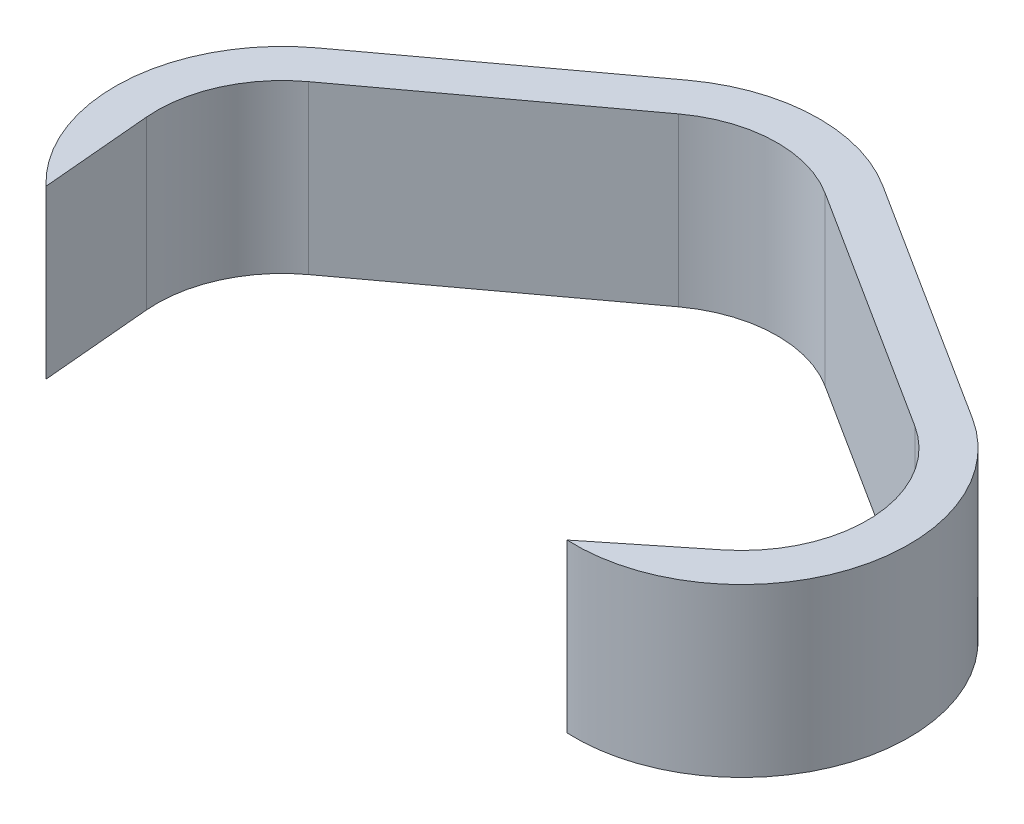
ISO-10303-21;
HEADER;
FILE_DESCRIPTION(('STEP AP214'),'2;1');
FILE_NAME('part.step','',(''),(''),'','','');
FILE_SCHEMA(('AUTOMOTIVE_DESIGN { 1 0 10303 214 1 1 1 1 }'));
ENDSEC;
DATA;
#1=APPLICATION_CONTEXT('core data for automotive mechanical design processes');
#2=APPLICATION_PROTOCOL_DEFINITION('international standard','automotive_design',2000,#1);
#3=PRODUCT_CONTEXT('',#1,'mechanical');
#4=PRODUCT('Part','Part','',(#3));
#5=PRODUCT_RELATED_PRODUCT_CATEGORY('part','',(#4));
#6=PRODUCT_DEFINITION_FORMATION('','',#4);
#7=PRODUCT_DEFINITION_CONTEXT('part definition',#1,'design');
#8=PRODUCT_DEFINITION('design','',#6,#7);
#9=PRODUCT_DEFINITION_SHAPE('','',#8);
#10=(LENGTH_UNIT() NAMED_UNIT(*) SI_UNIT(.MILLI.,.METRE.));
#11=(NAMED_UNIT(*) PLANE_ANGLE_UNIT() SI_UNIT($,.RADIAN.));
#12=(NAMED_UNIT(*) SI_UNIT($,.STERADIAN.) SOLID_ANGLE_UNIT());
#13=UNCERTAINTY_MEASURE_WITH_UNIT(LENGTH_MEASURE(1.E-05),#10,'distance_accuracy_value','');
#14=(GEOMETRIC_REPRESENTATION_CONTEXT(3) GLOBAL_UNCERTAINTY_ASSIGNED_CONTEXT((#13)) GLOBAL_UNIT_ASSIGNED_CONTEXT((#10,
#11,#12)) REPRESENTATION_CONTEXT('',''));
#15=CARTESIAN_POINT('',(0.,0.,0.));
#16=DIRECTION('',(0.,0.,1.));
#17=DIRECTION('',(1.,0.,0.));
#18=AXIS2_PLACEMENT_3D('',#15,#16,#17);
#19=CARTESIAN_POINT('',(-11.3075349976395,25.4,-15.3310845107956));
#20=DIRECTION('',(0.593571390952207,0.,0.804781339149376));
#21=DIRECTION('',(0.804781339149376,0.,-0.593571390952207));
#22=AXIS2_PLACEMENT_3D('',#19,#20,#21);
#23=PLANE('',#22);
#24=DIRECTION('',(-0.804781339149376,0.,0.593571390952207));
#25=VECTOR('',#24,1.);
#26=CARTESIAN_POINT('',(-11.3075349976395,0.,-15.3310845107956));
#27=LINE('',#26,#25);
#28=CARTESIAN_POINT('',(-11.3075349976395,0.,-15.3310845107956));
#29=VERTEX_POINT('',#28);
#30=CARTESIAN_POINT('',(-43.6511110666287,0.,8.5241175195226));
#31=VERTEX_POINT('',#30);
#32=EDGE_CURVE('E156',#29,#31,#27,.T.);
#33=ORIENTED_EDGE('',*,*,#32,.F.);
#34=DIRECTION('',(0.,-1.,0.));
#35=VECTOR('',#34,1.);
#36=CARTESIAN_POINT('',(-11.3075349976395,25.4,-15.3310845107956));
#37=LINE('',#36,#35);
#38=CARTESIAN_POINT('',(-11.3075349976395,25.4,-15.3310845107956));
#39=VERTEX_POINT('',#38);
#40=EDGE_CURVE('E11',#39,#29,#37,.T.);
#41=ORIENTED_EDGE('',*,*,#40,.F.);
#42=DIRECTION('',(-0.804781339149376,0.,0.593571390952207));
#43=VECTOR('',#42,1.);
#44=CARTESIAN_POINT('',(-11.3075349976395,25.4,-15.3310845107956));
#45=LINE('',#44,#43);
#46=CARTESIAN_POINT('',(-43.6511110666287,25.4,8.5241175195226));
#47=VERTEX_POINT('',#46);
#48=EDGE_CURVE('E189',#39,#47,#45,.T.);
#49=ORIENTED_EDGE('',*,*,#48,.T.);
#50=DIRECTION('',(0.,-1.,0.));
#51=VECTOR('',#50,1.);
#52=CARTESIAN_POINT('',(-43.6511110666287,25.4,8.5241175195226));
#53=LINE('',#52,#51);
#54=EDGE_CURVE('E60',#47,#31,#53,.T.);
#55=ORIENTED_EDGE('',*,*,#54,.T.);
#56=EDGE_LOOP('',(#33,#41,#49,#55));
#57=FACE_BOUND('',#56,.T.);
#58=ADVANCED_FACE('F41',(#57),#23,.T.);
#59=CARTESIAN_POINT('',(0.,25.4,0.));
#60=DIRECTION('',(0.,-1.,0.));
#61=DIRECTION('',(0.,0.,-1.));
#62=AXIS2_PLACEMENT_3D('',#59,#60,#61);
#63=CYLINDRICAL_SURFACE('',#62,19.05);
#64=CARTESIAN_POINT('',(0.,0.,0.));
#65=DIRECTION('',(0.,1.,0.));
#66=DIRECTION('',(0.,0.,1.));
#67=AXIS2_PLACEMENT_3D('',#64,#65,#66);
#68=CIRCLE('',#67,19.05);
#69=CARTESIAN_POINT('',(10.2236580129935,0.,-16.0741816847189));
#70=VERTEX_POINT('',#69);
#71=EDGE_CURVE('E159',#70,#29,#68,.T.);
#72=ORIENTED_EDGE('',*,*,#71,.F.);
#73=DIRECTION('',(0.,-1.,0.));
#74=VECTOR('',#73,1.);
#75=CARTESIAN_POINT('',(10.2236580129935,25.4,-16.0741816847189));
#76=LINE('',#75,#74);
#77=CARTESIAN_POINT('',(10.2236580129935,25.4,-16.0741816847189));
#78=VERTEX_POINT('',#77);
#79=EDGE_CURVE('E47',#78,#70,#76,.T.);
#80=ORIENTED_EDGE('',*,*,#79,.F.);
#81=CARTESIAN_POINT('',(0.,25.4,0.));
#82=DIRECTION('',(0.,1.,0.));
#83=DIRECTION('',(0.,0.,1.));
#84=AXIS2_PLACEMENT_3D('',#81,#82,#83);
#85=CIRCLE('',#84,19.05);
#86=EDGE_CURVE('E220',#78,#39,#85,.T.);
#87=ORIENTED_EDGE('',*,*,#86,.T.);
#88=ORIENTED_EDGE('',*,*,#40,.T.);
#89=EDGE_LOOP('',(#72,#80,#87,#88));
#90=FACE_BOUND('',#89,.T.);
#91=ADVANCED_FACE('F216',(#90),#63,.F.);
#92=CARTESIAN_POINT('',(10.2236580129935,25.4,-16.0741816847189));
#93=DIRECTION('',(0.536674961311996,0.,-0.843789064814642));
#94=DIRECTION('',(-0.843789064814642,0.,-0.536674961311996));
#95=AXIS2_PLACEMENT_3D('',#92,#93,#94);
#96=PLANE('',#95);
#97=DIRECTION('',(0.843789064814642,0.,0.536674961311996));
#98=VECTOR('',#97,1.);
#99=CARTESIAN_POINT('',(10.2236580129935,0.,-16.0741816847189));
#100=LINE('',#99,#98);
#101=CARTESIAN_POINT('',(47.7300819440043,0.,7.78102034559929));
#102=VERTEX_POINT('',#101);
#103=EDGE_CURVE('E161',#70,#102,#100,.T.);
#104=ORIENTED_EDGE('',*,*,#103,.T.);
#105=DIRECTION('',(0.,-1.,0.));
#106=VECTOR('',#105,1.);
#107=CARTESIAN_POINT('',(47.7300819440043,25.4,7.78102034559929));
#108=LINE('',#107,#106);
#109=CARTESIAN_POINT('',(47.7300819440043,25.4,7.78102034559929));
#110=VERTEX_POINT('',#109);
#111=EDGE_CURVE('E201',#110,#102,#108,.T.);
#112=ORIENTED_EDGE('',*,*,#111,.F.);
#113=DIRECTION('',(0.843789064814642,0.,0.536674961311996));
#114=VECTOR('',#113,1.);
#115=CARTESIAN_POINT('',(10.2236580129935,25.4,-16.0741816847189));
#116=LINE('',#115,#114);
#117=EDGE_CURVE('E209',#78,#110,#116,.T.);
#118=ORIENTED_EDGE('',*,*,#117,.F.);
#119=ORIENTED_EDGE('',*,*,#79,.T.);
#120=EDGE_LOOP('',(#104,#112,#118,#119));
#121=FACE_BOUND('',#120,.T.);
#122=ADVANCED_FACE('F210',(#121),#96,.F.);
#123=CARTESIAN_POINT('',(37.5064239310108,25.4,23.8552020303182));
#124=DIRECTION('',(0.,-1.,0.));
#125=DIRECTION('',(0.,0.,-1.));
#126=AXIS2_PLACEMENT_3D('',#123,#124,#125);
#127=CYLINDRICAL_SURFACE('',#126,19.05);
#128=CARTESIAN_POINT('',(37.5064239310108,0.,23.8552020303182));
#129=DIRECTION('',(0.,1.,0.));
#130=DIRECTION('',(0.,0.,1.));
#131=AXIS2_PLACEMENT_3D('',#128,#129,#130);
#132=CIRCLE('',#131,19.05);
#133=CARTESIAN_POINT('',(49.4279657924979,0.,38.7138473132776));
#134=VERTEX_POINT('',#133);
#135=EDGE_CURVE('E168',#134,#102,#132,.T.);
#136=ORIENTED_EDGE('',*,*,#135,.F.);
#137=DIRECTION('',(0.,-1.,0.));
#138=VECTOR('',#137,1.);
#139=CARTESIAN_POINT('',(49.4279657924979,25.4,38.7138473132776));
#140=LINE('',#139,#138);
#141=CARTESIAN_POINT('',(49.4279657924979,25.4,38.7138473132776));
#142=VERTEX_POINT('',#141);
#143=EDGE_CURVE('E203',#142,#134,#140,.T.);
#144=ORIENTED_EDGE('',*,*,#143,.F.);
#145=CARTESIAN_POINT('',(37.5064239310108,25.4,23.8552020303182));
#146=DIRECTION('',(0.,1.,0.));
#147=DIRECTION('',(0.,0.,1.));
#148=AXIS2_PLACEMENT_3D('',#145,#146,#147);
#149=CIRCLE('',#148,19.05);
#150=EDGE_CURVE('E422',#142,#110,#149,.T.);
#151=ORIENTED_EDGE('',*,*,#150,.T.);
#152=ORIENTED_EDGE('',*,*,#111,.T.);
#153=EDGE_LOOP('',(#136,#144,#151,#152));
#154=FACE_BOUND('',#153,.T.);
#155=ADVANCED_FACE('F236',(#154),#127,.F.);
#156=CARTESIAN_POINT('',(38.2542162502866,25.4,47.6788855371872));
#157=DIRECTION('',(-0.625802722387774,0.,-0.779981379682906));
#158=DIRECTION('',(-0.779981379682907,0.,0.625802722387774));
#159=AXIS2_PLACEMENT_3D('',#156,#157,#158);
#160=PLANE('',#159);
#161=DIRECTION('',(0.779981379682906,0.,-0.625802722387774));
#162=VECTOR('',#161,1.);
#163=CARTESIAN_POINT('',(38.2542162502866,0.,47.6788855371872));
#164=LINE('',#163,#162);
#165=CARTESIAN_POINT('',(36.3238723798202,0.,49.2276589832579));
#166=VERTEX_POINT('',#165);
#167=EDGE_CURVE('E169',#166,#134,#164,.T.);
#168=ORIENTED_EDGE('',*,*,#167,.F.);
#169=DIRECTION('',(0.,-1.,0.));
#170=VECTOR('',#169,1.);
#171=CARTESIAN_POINT('',(36.3238723798202,25.4,49.2276589832579));
#172=LINE('',#171,#170);
#173=CARTESIAN_POINT('',(36.3238723798202,25.4,49.2276589832579));
#174=VERTEX_POINT('',#173);
#175=EDGE_CURVE('E198',#174,#166,#172,.T.);
#176=ORIENTED_EDGE('',*,*,#175,.F.);
#177=DIRECTION('',(0.779981379682906,0.,-0.625802722387774));
#178=VECTOR('',#177,1.);
#179=CARTESIAN_POINT('',(38.2542162502866,25.4,47.6788855371872));
#180=LINE('',#179,#178);
#181=EDGE_CURVE('E417',#174,#142,#180,.T.);
#182=ORIENTED_EDGE('',*,*,#181,.T.);
#183=ORIENTED_EDGE('',*,*,#143,.T.);
#184=EDGE_LOOP('',(#168,#176,#182,#183));
#185=FACE_BOUND('',#184,.T.);
#186=ADVANCED_FACE('F241',(#185),#160,.T.);
#187=CARTESIAN_POINT('',(37.5064239310108,25.4,23.8552020303182));
#188=DIRECTION('',(0.,-1.,0.));
#189=DIRECTION('',(0.,0.,-1.));
#190=AXIS2_PLACEMENT_3D('',#187,#188,#189);
#191=CYLINDRICAL_SURFACE('',#190,25.4);
#192=CARTESIAN_POINT('',(37.5064239310108,0.,23.8552020303182));
#193=DIRECTION('',(0.,1.,0.));
#194=DIRECTION('',(0.,0.,1.));
#195=AXIS2_PLACEMENT_3D('',#192,#193,#194);
#196=CIRCLE('',#195,25.4);
#197=CARTESIAN_POINT('',(51.1379679483355,0.,2.42295978402633));
#198=VERTEX_POINT('',#197);
#199=EDGE_CURVE('E175',#166,#198,#196,.T.);
#200=ORIENTED_EDGE('',*,*,#199,.T.);
#201=DIRECTION('',(0.,-1.,0.));
#202=VECTOR('',#201,1.);
#203=CARTESIAN_POINT('',(51.1379679483355,25.4,2.42295978402633));
#204=LINE('',#203,#202);
#205=CARTESIAN_POINT('',(51.1379679483355,25.4,2.42295978402633));
#206=VERTEX_POINT('',#205);
#207=EDGE_CURVE('E196',#206,#198,#204,.T.);
#208=ORIENTED_EDGE('',*,*,#207,.F.);
#209=CARTESIAN_POINT('',(37.5064239310108,25.4,23.8552020303182));
#210=DIRECTION('',(0.,1.,0.));
#211=DIRECTION('',(0.,0.,1.));
#212=AXIS2_PLACEMENT_3D('',#209,#210,#211);
#213=CIRCLE('',#212,25.4);
#214=EDGE_CURVE('E425',#174,#206,#213,.T.);
#215=ORIENTED_EDGE('',*,*,#214,.F.);
#216=ORIENTED_EDGE('',*,*,#175,.T.);
#217=EDGE_LOOP('',(#200,#208,#215,#216));
#218=FACE_BOUND('',#217,.T.);
#219=ADVANCED_FACE('F244',(#218),#191,.T.);
#220=CARTESIAN_POINT('',(13.6315440173247,25.4,-21.4322422462919));
#221=DIRECTION('',(0.536674961311996,0.,-0.843789064814642));
#222=DIRECTION('',(-0.843789064814642,0.,-0.536674961311996));
#223=AXIS2_PLACEMENT_3D('',#220,#221,#222);
#224=PLANE('',#223);
#225=DIRECTION('',(0.843789064814642,0.,0.536674961311996));
#226=VECTOR('',#225,1.);
#227=CARTESIAN_POINT('',(13.6315440173247,0.,-21.4322422462919));
#228=LINE('',#227,#226);
#229=CARTESIAN_POINT('',(13.6315440173247,0.,-21.4322422462919));
#230=VERTEX_POINT('',#229);
#231=EDGE_CURVE('E174',#230,#198,#228,.T.);
#232=ORIENTED_EDGE('',*,*,#231,.F.);
#233=DIRECTION('',(0.,-1.,0.));
#234=VECTOR('',#233,1.);
#235=CARTESIAN_POINT('',(13.6315440173247,25.4,-21.4322422462919));
#236=LINE('',#235,#234);
#237=CARTESIAN_POINT('',(13.6315440173247,25.4,-21.4322422462919));
#238=VERTEX_POINT('',#237);
#239=EDGE_CURVE('E193',#238,#230,#236,.T.);
#240=ORIENTED_EDGE('',*,*,#239,.F.);
#241=DIRECTION('',(0.843789064814642,0.,0.536674961311996));
#242=VECTOR('',#241,1.);
#243=CARTESIAN_POINT('',(13.6315440173247,25.4,-21.4322422462919));
#244=LINE('',#243,#242);
#245=EDGE_CURVE('E413',#238,#206,#244,.T.);
#246=ORIENTED_EDGE('',*,*,#245,.T.);
#247=ORIENTED_EDGE('',*,*,#207,.T.);
#248=EDGE_LOOP('',(#232,#240,#246,#247));
#249=FACE_BOUND('',#248,.T.);
#250=ADVANCED_FACE('F248',(#249),#224,.T.);
#251=CARTESIAN_POINT('',(0.,25.4,0.));
#252=DIRECTION('',(0.,-1.,0.));
#253=DIRECTION('',(0.,0.,-1.));
#254=AXIS2_PLACEMENT_3D('',#251,#252,#253);
#255=CYLINDRICAL_SURFACE('',#254,25.4);
#256=CARTESIAN_POINT('',(0.,0.,0.));
#257=DIRECTION('',(0.,1.,0.));
#258=DIRECTION('',(0.,0.,1.));
#259=AXIS2_PLACEMENT_3D('',#256,#257,#258);
#260=CIRCLE('',#259,25.4);
#261=CARTESIAN_POINT('',(-15.0767133301861,0.,-20.4414460143941));
#262=VERTEX_POINT('',#261);
#263=EDGE_CURVE('E178',#230,#262,#260,.T.);
#264=ORIENTED_EDGE('',*,*,#263,.T.);
#265=DIRECTION('',(0.,-1.,0.));
#266=VECTOR('',#265,1.);
#267=CARTESIAN_POINT('',(-15.0767133301861,25.4,-20.4414460143941));
#268=LINE('',#267,#266);
#269=CARTESIAN_POINT('',(-15.0767133301861,25.4,-20.4414460143941));
#270=VERTEX_POINT('',#269);
#271=EDGE_CURVE('E195',#270,#262,#268,.T.);
#272=ORIENTED_EDGE('',*,*,#271,.F.);
#273=CARTESIAN_POINT('',(0.,25.4,0.));
#274=DIRECTION('',(0.,1.,0.));
#275=DIRECTION('',(0.,0.,1.));
#276=AXIS2_PLACEMENT_3D('',#273,#274,#275);
#277=CIRCLE('',#276,25.4);
#278=EDGE_CURVE('E431',#238,#270,#277,.T.);
#279=ORIENTED_EDGE('',*,*,#278,.F.);
#280=ORIENTED_EDGE('',*,*,#239,.T.);
#281=EDGE_LOOP('',(#264,#272,#279,#280));
#282=FACE_BOUND('',#281,.T.);
#283=ADVANCED_FACE('F254',(#282),#255,.T.);
#284=CARTESIAN_POINT('',(-15.0767133301861,25.4,-20.4414460143942));
#285=DIRECTION('',(0.593571390952207,0.,0.804781339149376));
#286=DIRECTION('',(0.804781339149376,0.,-0.593571390952207));
#287=AXIS2_PLACEMENT_3D('',#284,#285,#286);
#288=PLANE('',#287);
#289=DIRECTION('',(-0.804781339149376,0.,0.593571390952207));
#290=VECTOR('',#289,1.);
#291=CARTESIAN_POINT('',(-15.0767133301861,0.,-20.4414460143942));
#292=LINE('',#291,#290);
#293=CARTESIAN_POINT('',(-47.4202893991752,0.,3.41375601592407));
#294=VERTEX_POINT('',#293);
#295=EDGE_CURVE('E179',#262,#294,#292,.T.);
#296=ORIENTED_EDGE('',*,*,#295,.T.);
#297=DIRECTION('',(0.,-1.,0.));
#298=VECTOR('',#297,1.);
#299=CARTESIAN_POINT('',(-47.4202893991752,25.4,3.41375601592407));
#300=LINE('',#299,#298);
#301=CARTESIAN_POINT('',(-47.4202893991752,25.4,3.41375601592407));
#302=VERTEX_POINT('',#301);
#303=EDGE_CURVE('E148',#302,#294,#300,.T.);
#304=ORIENTED_EDGE('',*,*,#303,.F.);
#305=DIRECTION('',(-0.804781339149376,0.,0.593571390952207));
#306=VECTOR('',#305,1.);
#307=CARTESIAN_POINT('',(-15.0767133301861,25.4,-20.4414460143942));
#308=LINE('',#307,#306);
#309=EDGE_CURVE('E136',#270,#302,#308,.T.);
#310=ORIENTED_EDGE('',*,*,#309,.F.);
#311=ORIENTED_EDGE('',*,*,#271,.T.);
#312=EDGE_LOOP('',(#296,#304,#310,#311));
#313=FACE_BOUND('',#312,.T.);
#314=ADVANCED_FACE('F260',(#313),#288,.F.);
#315=CARTESIAN_POINT('',(-32.3435760689892,25.4,23.8552020303182));
#316=DIRECTION('',(0.,-1.,0.));
#317=DIRECTION('',(0.,0.,-1.));
#318=AXIS2_PLACEMENT_3D('',#315,#316,#317);
#319=CYLINDRICAL_SURFACE('',#318,25.4);
#320=CARTESIAN_POINT('',(-32.3435760689892,0.,23.8552020303182));
#321=DIRECTION('',(0.,1.,0.));
#322=DIRECTION('',(0.,0.,1.));
#323=AXIS2_PLACEMENT_3D('',#320,#321,#322);
#324=CIRCLE('',#323,25.4);
#325=CARTESIAN_POINT('',(-49.8465429949894,0.,42.2618896407315));
#326=VERTEX_POINT('',#325);
#327=EDGE_CURVE('E150',#294,#326,#324,.T.);
#328=ORIENTED_EDGE('',*,*,#327,.T.);
#329=DIRECTION('',(0.,-1.,0.));
#330=VECTOR('',#329,1.);
#331=CARTESIAN_POINT('',(-49.8465429949894,25.4,42.2618896407315));
#332=LINE('',#331,#330);
#333=CARTESIAN_POINT('',(-49.8465429949894,25.4,42.2618896407315));
#334=VERTEX_POINT('',#333);
#335=EDGE_CURVE('E144',#334,#326,#332,.T.);
#336=ORIENTED_EDGE('',*,*,#335,.F.);
#337=CARTESIAN_POINT('',(-32.3435760689892,25.4,23.8552020303182));
#338=DIRECTION('',(0.,1.,0.));
#339=DIRECTION('',(0.,0.,1.));
#340=AXIS2_PLACEMENT_3D('',#337,#338,#339);
#341=CIRCLE('',#340,25.4);
#342=EDGE_CURVE('E134',#302,#334,#341,.T.);
#343=ORIENTED_EDGE('',*,*,#342,.F.);
#344=ORIENTED_EDGE('',*,*,#303,.T.);
#345=EDGE_LOOP('',(#328,#336,#343,#344));
#346=FACE_BOUND('',#345,.T.);
#347=ADVANCED_FACE('F143',(#346),#319,.T.);
#348=CARTESIAN_POINT('',(-53.1556503920439,25.4,4.68044108662597));
#349=DIRECTION('',(0.996145852909527,0.,-0.0877122553076252));
#350=DIRECTION('',(-0.0877122553076252,0.,-0.996145852909528));
#351=AXIS2_PLACEMENT_3D('',#348,#349,#350);
#352=PLANE('',#351);
#353=DIRECTION('',(0.0877122553076252,0.,0.996145852909528));
#354=VECTOR('',#353,1.);
#355=CARTESIAN_POINT('',(-53.1556503920439,0.,4.68044108662597));
#356=LINE('',#355,#354);
#357=CARTESIAN_POINT('',(-51.3201545669157,0.,25.5261204939285));
#358=VERTEX_POINT('',#357);
#359=EDGE_CURVE('E182',#358,#326,#356,.T.);
#360=ORIENTED_EDGE('',*,*,#359,.F.);
#361=DIRECTION('',(0.,-1.,0.));
#362=VECTOR('',#361,1.);
#363=CARTESIAN_POINT('',(-51.3201545669157,25.4,25.5261204939285));
#364=LINE('',#363,#362);
#365=CARTESIAN_POINT('',(-51.3201545669157,25.4,25.5261204939285));
#366=VERTEX_POINT('',#365);
#367=EDGE_CURVE('E92',#366,#358,#364,.T.);
#368=ORIENTED_EDGE('',*,*,#367,.F.);
#369=DIRECTION('',(0.0877122553076252,0.,0.996145852909528));
#370=VECTOR('',#369,1.);
#371=CARTESIAN_POINT('',(-53.1556503920439,25.4,4.68044108662597));
#372=LINE('',#371,#370);
#373=EDGE_CURVE('E138',#366,#334,#372,.T.);
#374=ORIENTED_EDGE('',*,*,#373,.T.);
#375=ORIENTED_EDGE('',*,*,#335,.T.);
#376=EDGE_LOOP('',(#360,#368,#374,#375));
#377=FACE_BOUND('',#376,.T.);
#378=ADVANCED_FACE('F151',(#377),#352,.T.);
#379=CARTESIAN_POINT('',(-32.3435760689892,25.4,23.8552020303182));
#380=DIRECTION('',(0.,-1.,0.));
#381=DIRECTION('',(0.,0.,-1.));
#382=AXIS2_PLACEMENT_3D('',#379,#380,#381);
#383=CYLINDRICAL_SURFACE('',#382,19.05);
#384=CARTESIAN_POINT('',(-32.3435760689892,0.,23.8552020303182));
#385=DIRECTION('',(0.,1.,0.));
#386=DIRECTION('',(0.,0.,1.));
#387=AXIS2_PLACEMENT_3D('',#384,#385,#386);
#388=CIRCLE('',#387,19.05);
#389=EDGE_CURVE('E184',#31,#358,#388,.T.);
#390=ORIENTED_EDGE('',*,*,#389,.F.);
#391=ORIENTED_EDGE('',*,*,#54,.F.);
#392=CARTESIAN_POINT('',(-32.3435760689892,25.4,23.8552020303182));
#393=DIRECTION('',(0.,1.,0.));
#394=DIRECTION('',(0.,0.,1.));
#395=AXIS2_PLACEMENT_3D('',#392,#393,#394);
#396=CIRCLE('',#395,19.05);
#397=EDGE_CURVE('E155',#47,#366,#396,.T.);
#398=ORIENTED_EDGE('',*,*,#397,.T.);
#399=ORIENTED_EDGE('',*,*,#367,.T.);
#400=EDGE_LOOP('',(#390,#391,#398,#399));
#401=FACE_BOUND('',#400,.T.);
#402=ADVANCED_FACE('F218',(#401),#383,.F.);
#403=CARTESIAN_POINT('',(0.,25.4,0.));
#404=DIRECTION('',(0.,1.,0.));
#405=DIRECTION('',(0.,0.,1.));
#406=AXIS2_PLACEMENT_3D('',#403,#404,#405);
#407=PLANE('',#406);
#408=ORIENTED_EDGE('',*,*,#48,.F.);
#409=ORIENTED_EDGE('',*,*,#86,.F.);
#410=ORIENTED_EDGE('',*,*,#117,.T.);
#411=ORIENTED_EDGE('',*,*,#150,.F.);
#412=ORIENTED_EDGE('',*,*,#181,.F.);
#413=ORIENTED_EDGE('',*,*,#214,.T.);
#414=ORIENTED_EDGE('',*,*,#245,.F.);
#415=ORIENTED_EDGE('',*,*,#278,.T.);
#416=ORIENTED_EDGE('',*,*,#309,.T.);
#417=ORIENTED_EDGE('',*,*,#342,.T.);
#418=ORIENTED_EDGE('',*,*,#373,.F.);
#419=ORIENTED_EDGE('',*,*,#397,.F.);
#420=EDGE_LOOP('',(#408,#409,#410,#411,#412,#413,#414,#415,#416,#417,#418,#419));
#421=FACE_BOUND('',#420,.T.);
#422=ADVANCED_FACE('F135',(#421),#407,.T.);
#423=CARTESIAN_POINT('',(0.,0.,0.));
#424=DIRECTION('',(0.,1.,0.));
#425=DIRECTION('',(0.,0.,1.));
#426=AXIS2_PLACEMENT_3D('',#423,#424,#425);
#427=PLANE('',#426);
#428=ORIENTED_EDGE('',*,*,#32,.T.);
#429=ORIENTED_EDGE('',*,*,#389,.T.);
#430=ORIENTED_EDGE('',*,*,#359,.T.);
#431=ORIENTED_EDGE('',*,*,#327,.F.);
#432=ORIENTED_EDGE('',*,*,#295,.F.);
#433=ORIENTED_EDGE('',*,*,#263,.F.);
#434=ORIENTED_EDGE('',*,*,#231,.T.);
#435=ORIENTED_EDGE('',*,*,#199,.F.);
#436=ORIENTED_EDGE('',*,*,#167,.T.);
#437=ORIENTED_EDGE('',*,*,#135,.T.);
#438=ORIENTED_EDGE('',*,*,#103,.F.);
#439=ORIENTED_EDGE('',*,*,#71,.T.);
#440=EDGE_LOOP('',(#428,#429,#430,#431,#432,#433,#434,#435,#436,#437,#438,#439));
#441=FACE_BOUND('',#440,.T.);
#442=ADVANCED_FACE('F213',(#441),#427,.F.);
#443=CLOSED_SHELL('',(#58,#91,#122,#155,#186,#219,#250,#283,#314,#347,#378,#402,#422,#442));
#444=MANIFOLD_SOLID_BREP('B2',#443);
#445=ADVANCED_BREP_SHAPE_REPRESENTATION('',(#18,#444),#14);
#446=SHAPE_DEFINITION_REPRESENTATION(#9,#445);
ENDSEC;
END-ISO-10303-21;
